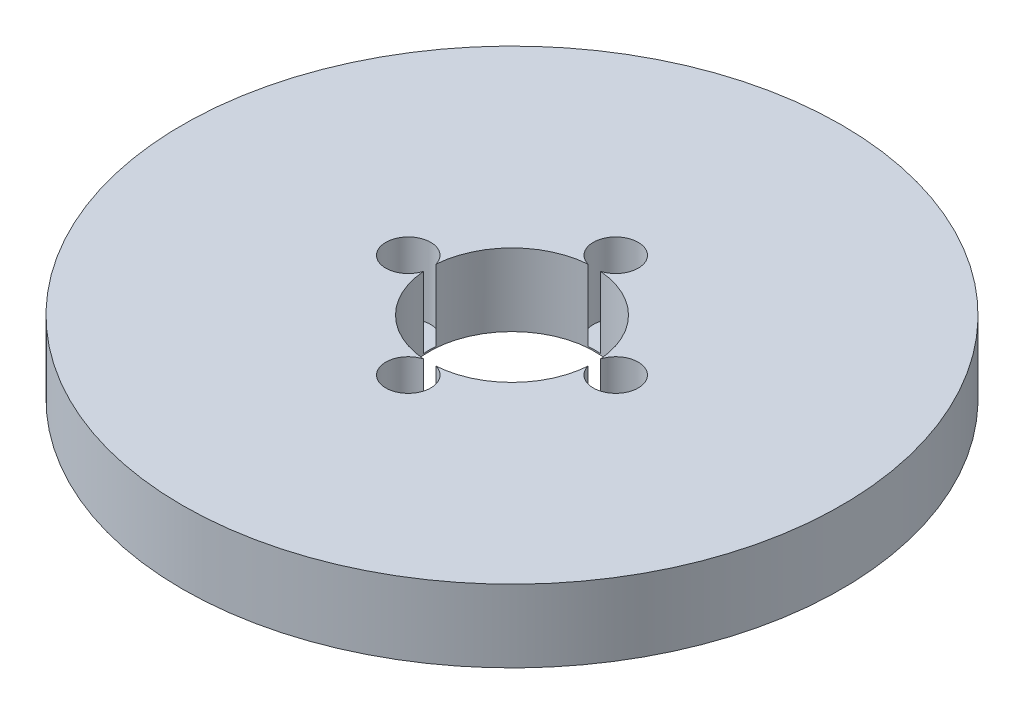
ISO-10303-21;
HEADER;
FILE_DESCRIPTION(('STEP AP214'),'2;1');
FILE_NAME('part.step','',(''),(''),'','','');
FILE_SCHEMA(('AUTOMOTIVE_DESIGN { 1 0 10303 214 1 1 1 1 }'));
ENDSEC;
DATA;
#1=APPLICATION_CONTEXT('core data for automotive mechanical design processes');
#2=APPLICATION_PROTOCOL_DEFINITION('international standard','automotive_design',2000,#1);
#3=PRODUCT_CONTEXT('',#1,'mechanical');
#4=PRODUCT('Part','Part','',(#3));
#5=PRODUCT_RELATED_PRODUCT_CATEGORY('part','',(#4));
#6=PRODUCT_DEFINITION_FORMATION('','',#4);
#7=PRODUCT_DEFINITION_CONTEXT('part definition',#1,'design');
#8=PRODUCT_DEFINITION('design','',#6,#7);
#9=PRODUCT_DEFINITION_SHAPE('','',#8);
#10=(LENGTH_UNIT() NAMED_UNIT(*) SI_UNIT(.MILLI.,.METRE.));
#11=(NAMED_UNIT(*) PLANE_ANGLE_UNIT() SI_UNIT($,.RADIAN.));
#12=(NAMED_UNIT(*) SI_UNIT($,.STERADIAN.) SOLID_ANGLE_UNIT());
#13=UNCERTAINTY_MEASURE_WITH_UNIT(LENGTH_MEASURE(1.E-05),#10,'distance_accuracy_value','');
#14=(GEOMETRIC_REPRESENTATION_CONTEXT(3) GLOBAL_UNCERTAINTY_ASSIGNED_CONTEXT((#13)) GLOBAL_UNIT_ASSIGNED_CONTEXT((#10,
#11,#12)) REPRESENTATION_CONTEXT('',''));
#15=CARTESIAN_POINT('',(0.,0.,0.));
#16=DIRECTION('',(0.,0.,1.));
#17=DIRECTION('',(1.,0.,0.));
#18=AXIS2_PLACEMENT_3D('',#15,#16,#17);
#19=CARTESIAN_POINT('',(0.,11.,0.));
#20=DIRECTION('',(0.,-1.,0.));
#21=DIRECTION('',(0.,0.,-1.));
#22=AXIS2_PLACEMENT_3D('',#19,#20,#21);
#23=CYLINDRICAL_SURFACE('',#22,50.);
#24=CARTESIAN_POINT('',(0.,11.,0.));
#25=DIRECTION('',(0.,1.,0.));
#26=DIRECTION('',(0.,0.,1.));
#27=AXIS2_PLACEMENT_3D('',#24,#25,#26);
#28=CIRCLE('',#27,50.);
#29=CARTESIAN_POINT('',(0.,11.,50.));
#30=VERTEX_POINT('',#29);
#31=EDGE_CURVE('E145',#30,#30,#28,.T.);
#32=ORIENTED_EDGE('',*,*,#31,.F.);
#33=EDGE_LOOP('',(#32));
#34=FACE_BOUND('',#33,.T.);
#35=CARTESIAN_POINT('',(0.,0.,0.));
#36=DIRECTION('',(0.,1.,0.));
#37=DIRECTION('',(0.,0.,1.));
#38=AXIS2_PLACEMENT_3D('',#35,#36,#37);
#39=CIRCLE('',#38,50.);
#40=CARTESIAN_POINT('',(0.,0.,50.));
#41=VERTEX_POINT('',#40);
#42=EDGE_CURVE('E143',#41,#41,#39,.T.);
#43=ORIENTED_EDGE('',*,*,#42,.T.);
#44=EDGE_LOOP('',(#43));
#45=FACE_BOUND('',#44,.T.);
#46=ADVANCED_FACE('F39',(#34,#45),#23,.T.);
#47=CARTESIAN_POINT('',(0.,11.,0.));
#48=DIRECTION('',(0.,1.,0.));
#49=DIRECTION('',(0.,0.,1.));
#50=AXIS2_PLACEMENT_3D('',#47,#48,#49);
#51=PLANE('',#50);
#52=CARTESIAN_POINT('',(0.,11.,15.7398733575074));
#53=DIRECTION('',(0.,1.,0.));
#54=DIRECTION('',(1.,0.,0.));
#55=AXIS2_PLACEMENT_3D('',#52,#53,#54);
#56=CIRCLE('',#55,3.40899028966621);
#57=CARTESIAN_POINT('',(-0.944302572630774,11.,12.464280671235));
#58=VERTEX_POINT('',#57);
#59=CARTESIAN_POINT('',(0.944302572630861,11.,12.464280671235));
#60=VERTEX_POINT('',#59);
#61=EDGE_CURVE('E152',#58,#60,#56,.T.);
#62=ORIENTED_EDGE('',*,*,#61,.F.);
#63=CARTESIAN_POINT('',(0.,11.,0.));
#64=DIRECTION('',(0.,1.,0.));
#65=DIRECTION('',(0.,0.,1.));
#66=AXIS2_PLACEMENT_3D('',#63,#64,#65);
#67=CIRCLE('',#66,12.5);
#68=CARTESIAN_POINT('',(-12.464280671235,11.,0.944302572630818));
#69=VERTEX_POINT('',#68);
#70=EDGE_CURVE('E133',#69,#58,#67,.T.);
#71=ORIENTED_EDGE('',*,*,#70,.F.);
#72=CARTESIAN_POINT('',(-15.7398733575074,11.,0.));
#73=DIRECTION('',(0.,1.,0.));
#74=DIRECTION('',(0.,0.,1.));
#75=AXIS2_PLACEMENT_3D('',#72,#73,#74);
#76=CIRCLE('',#75,3.40899028966621);
#77=CARTESIAN_POINT('',(-12.464280671235,11.,-0.944302572630818));
#78=VERTEX_POINT('',#77);
#79=EDGE_CURVE('E128',#78,#69,#76,.T.);
#80=ORIENTED_EDGE('',*,*,#79,.F.);
#81=CARTESIAN_POINT('',(-0.944302572630948,11.,-12.464280671235));
#82=VERTEX_POINT('',#81);
#83=EDGE_CURVE('E121',#82,#78,#67,.T.);
#84=ORIENTED_EDGE('',*,*,#83,.F.);
#85=CARTESIAN_POINT('',(-1.64866422310474E-13,11.,-15.7398733575074));
#86=DIRECTION('',(0.,1.,0.));
#87=DIRECTION('',(-1.,0.,0.));
#88=AXIS2_PLACEMENT_3D('',#85,#86,#87);
#89=CIRCLE('',#88,3.40899028966621);
#90=CARTESIAN_POINT('',(0.944302572630687,11.,-12.464280671235));
#91=VERTEX_POINT('',#90);
#92=EDGE_CURVE('E105',#91,#82,#89,.T.);
#93=ORIENTED_EDGE('',*,*,#92,.F.);
#94=CARTESIAN_POINT('',(12.464280671235,11.,-0.944302572630818));
#95=VERTEX_POINT('',#94);
#96=EDGE_CURVE('E131',#95,#91,#67,.T.);
#97=ORIENTED_EDGE('',*,*,#96,.F.);
#98=CARTESIAN_POINT('',(15.7398733575074,11.,0.));
#99=DIRECTION('',(0.,1.,0.));
#100=DIRECTION('',(0.,0.,-1.));
#101=AXIS2_PLACEMENT_3D('',#98,#99,#100);
#102=CIRCLE('',#101,3.40899028966621);
#103=CARTESIAN_POINT('',(12.464280671235,11.,0.944302572630818));
#104=VERTEX_POINT('',#103);
#105=EDGE_CURVE('E154',#104,#95,#102,.T.);
#106=ORIENTED_EDGE('',*,*,#105,.F.);
#107=EDGE_CURVE('E134',#60,#104,#67,.T.);
#108=ORIENTED_EDGE('',*,*,#107,.F.);
#109=EDGE_LOOP('',(#62,#71,#80,#84,#93,#97,#106,#108));
#110=FACE_BOUND('',#109,.T.);
#111=ORIENTED_EDGE('',*,*,#31,.T.);
#112=EDGE_LOOP('',(#111));
#113=FACE_BOUND('',#112,.T.);
#114=ADVANCED_FACE('F130',(#110,#113),#51,.T.);
#115=CARTESIAN_POINT('',(0.,0.,0.));
#116=DIRECTION('',(0.,1.,0.));
#117=DIRECTION('',(0.,0.,1.));
#118=AXIS2_PLACEMENT_3D('',#115,#116,#117);
#119=PLANE('',#118);
#120=CARTESIAN_POINT('',(0.,0.,0.));
#121=DIRECTION('',(0.,1.,0.));
#122=DIRECTION('',(0.,0.,1.));
#123=AXIS2_PLACEMENT_3D('',#120,#121,#122);
#124=CIRCLE('',#123,12.5);
#125=CARTESIAN_POINT('',(0.,0.,12.5));
#126=VERTEX_POINT('',#125);
#127=EDGE_CURVE('E135',#126,#126,#124,.T.);
#128=ORIENTED_EDGE('',*,*,#127,.T.);
#129=EDGE_LOOP('',(#128));
#130=FACE_BOUND('',#129,.T.);
#131=ORIENTED_EDGE('',*,*,#42,.F.);
#132=EDGE_LOOP('',(#131));
#133=FACE_BOUND('',#132,.T.);
#134=ADVANCED_FACE('F195',(#130,#133),#119,.F.);
#135=CARTESIAN_POINT('',(0.,11.,0.));
#136=DIRECTION('',(0.,-1.,0.));
#137=DIRECTION('',(0.,0.,-1.));
#138=AXIS2_PLACEMENT_3D('',#135,#136,#137);
#139=CYLINDRICAL_SURFACE('',#138,12.5);
#140=DIRECTION('',(0.,1.,0.));
#141=VECTOR('',#140,1.);
#142=CARTESIAN_POINT('',(-0.944302572630786,5.59821491136933,12.464280671235));
#143=LINE('',#142,#141);
#144=CARTESIAN_POINT('',(-0.944302572630774,0.196429822738669,12.464280671235));
#145=VERTEX_POINT('',#144);
#146=EDGE_CURVE('E11',#145,#58,#143,.T.);
#147=ORIENTED_EDGE('',*,*,#146,.F.);
#148=CARTESIAN_POINT('',(0.,0.196429822738669,0.));
#149=DIRECTION('',(0.,1.,0.));
#150=DIRECTION('',(0.,0.,1.));
#151=AXIS2_PLACEMENT_3D('',#148,#149,#150);
#152=CIRCLE('',#151,12.5);
#153=CARTESIAN_POINT('',(0.944302572630861,0.196429822738669,12.464280671235));
#154=VERTEX_POINT('',#153);
#155=EDGE_CURVE('E169',#145,#154,#152,.T.);
#156=ORIENTED_EDGE('',*,*,#155,.T.);
#157=DIRECTION('',(0.,1.,0.));
#158=VECTOR('',#157,1.);
#159=CARTESIAN_POINT('',(0.944302572630874,5.59821491136933,12.464280671235));
#160=LINE('',#159,#158);
#161=EDGE_CURVE('E46',#60,#154,#160,.F.);
#162=ORIENTED_EDGE('',*,*,#161,.F.);
#163=ORIENTED_EDGE('',*,*,#107,.T.);
#164=DIRECTION('',(0.,1.,0.));
#165=VECTOR('',#164,1.);
#166=CARTESIAN_POINT('',(12.464280671235,5.59821491136933,0.944302572630831));
#167=LINE('',#166,#165);
#168=CARTESIAN_POINT('',(12.464280671235,0.196429822738669,0.944302572630818));
#169=VERTEX_POINT('',#168);
#170=EDGE_CURVE('E151',#169,#104,#167,.T.);
#171=ORIENTED_EDGE('',*,*,#170,.F.);
#172=CARTESIAN_POINT('',(0.,0.196429822738669,0.));
#173=DIRECTION('',(0.,1.,0.));
#174=DIRECTION('',(0.,0.,1.));
#175=AXIS2_PLACEMENT_3D('',#172,#173,#174);
#176=CIRCLE('',#175,12.5);
#177=CARTESIAN_POINT('',(12.464280671235,0.196429822738669,-0.944302572630818));
#178=VERTEX_POINT('',#177);
#179=EDGE_CURVE('E173',#169,#178,#176,.T.);
#180=ORIENTED_EDGE('',*,*,#179,.T.);
#181=DIRECTION('',(0.,1.,0.));
#182=VECTOR('',#181,1.);
#183=CARTESIAN_POINT('',(12.464280671235,5.59821491136933,-0.944302572630831));
#184=LINE('',#183,#182);
#185=EDGE_CURVE('E168',#95,#178,#184,.F.);
#186=ORIENTED_EDGE('',*,*,#185,.F.);
#187=ORIENTED_EDGE('',*,*,#96,.T.);
#188=DIRECTION('',(0.,1.,0.));
#189=VECTOR('',#188,1.);
#190=CARTESIAN_POINT('',(0.944302572630699,5.59821491136933,-12.464280671235));
#191=LINE('',#190,#189);
#192=CARTESIAN_POINT('',(0.944302572630687,0.196429822738669,-12.464280671235));
#193=VERTEX_POINT('',#192);
#194=EDGE_CURVE('E108',#193,#91,#191,.T.);
#195=ORIENTED_EDGE('',*,*,#194,.F.);
#196=CARTESIAN_POINT('',(0.,0.196429822738669,0.));
#197=DIRECTION('',(0.,1.,0.));
#198=DIRECTION('',(0.,0.,1.));
#199=AXIS2_PLACEMENT_3D('',#196,#197,#198);
#200=CIRCLE('',#199,12.5);
#201=CARTESIAN_POINT('',(-0.944302572630948,0.196429822738669,-12.464280671235));
#202=VERTEX_POINT('',#201);
#203=EDGE_CURVE('E122',#193,#202,#200,.T.);
#204=ORIENTED_EDGE('',*,*,#203,.T.);
#205=DIRECTION('',(0.,1.,0.));
#206=VECTOR('',#205,1.);
#207=CARTESIAN_POINT('',(-0.944302572630961,5.59821491136933,-12.464280671235));
#208=LINE('',#207,#206);
#209=EDGE_CURVE('E106',#82,#202,#208,.F.);
#210=ORIENTED_EDGE('',*,*,#209,.F.);
#211=ORIENTED_EDGE('',*,*,#83,.T.);
#212=DIRECTION('',(0.,1.,0.));
#213=VECTOR('',#212,1.);
#214=CARTESIAN_POINT('',(-12.464280671235,5.59821491136933,-0.944302572630831));
#215=LINE('',#214,#213);
#216=CARTESIAN_POINT('',(-12.464280671235,0.196429822738669,-0.944302572630818));
#217=VERTEX_POINT('',#216);
#218=EDGE_CURVE('E177',#217,#78,#215,.T.);
#219=ORIENTED_EDGE('',*,*,#218,.F.);
#220=CARTESIAN_POINT('',(0.,0.196429822738669,0.));
#221=DIRECTION('',(0.,1.,0.));
#222=DIRECTION('',(0.,0.,1.));
#223=AXIS2_PLACEMENT_3D('',#220,#221,#222);
#224=CIRCLE('',#223,12.5);
#225=CARTESIAN_POINT('',(-12.464280671235,0.196429822738669,0.944302572630818));
#226=VERTEX_POINT('',#225);
#227=EDGE_CURVE('E185',#217,#226,#224,.T.);
#228=ORIENTED_EDGE('',*,*,#227,.T.);
#229=DIRECTION('',(0.,1.,0.));
#230=VECTOR('',#229,1.);
#231=CARTESIAN_POINT('',(-12.464280671235,5.59821491136933,0.944302572630831));
#232=LINE('',#231,#230);
#233=EDGE_CURVE('E179',#69,#226,#232,.F.);
#234=ORIENTED_EDGE('',*,*,#233,.F.);
#235=ORIENTED_EDGE('',*,*,#70,.T.);
#236=EDGE_LOOP('',(#147,#156,#162,#163,#171,#180,#186,#187,#195,#204,#210,#211,#219,#228,#234,#235));
#237=FACE_BOUND('',#236,.T.);
#238=ORIENTED_EDGE('',*,*,#127,.F.);
#239=EDGE_LOOP('',(#238));
#240=FACE_BOUND('',#239,.T.);
#241=ADVANCED_FACE('F117',(#237,#240),#139,.F.);
#242=CARTESIAN_POINT('',(-15.7398733575074,0.196429822738669,0.));
#243=DIRECTION('',(0.,1.,0.));
#244=DIRECTION('',(0.,0.,1.));
#245=AXIS2_PLACEMENT_3D('',#242,#243,#244);
#246=CYLINDRICAL_SURFACE('',#245,3.40899028966621);
#247=ORIENTED_EDGE('',*,*,#218,.T.);
#248=ORIENTED_EDGE('',*,*,#79,.T.);
#249=ORIENTED_EDGE('',*,*,#233,.T.);
#250=CARTESIAN_POINT('',(-15.7398733575074,0.196429822738669,0.));
#251=DIRECTION('',(0.,1.,0.));
#252=DIRECTION('',(0.,0.,1.));
#253=AXIS2_PLACEMENT_3D('',#250,#251,#252);
#254=CIRCLE('',#253,3.40899028966621);
#255=EDGE_CURVE('E140',#217,#226,#254,.T.);
#256=ORIENTED_EDGE('',*,*,#255,.F.);
#257=EDGE_LOOP('',(#247,#248,#249,#256));
#258=FACE_BOUND('',#257,.T.);
#259=ADVANCED_FACE('F200',(#258),#246,.F.);
#260=CARTESIAN_POINT('',(-15.7398733575074,0.196429822738669,0.));
#261=DIRECTION('',(0.,1.,0.));
#262=DIRECTION('',(0.,0.,1.));
#263=AXIS2_PLACEMENT_3D('',#260,#261,#262);
#264=PLANE('',#263);
#265=ORIENTED_EDGE('',*,*,#255,.T.);
#266=ORIENTED_EDGE('',*,*,#227,.F.);
#267=EDGE_LOOP('',(#265,#266));
#268=FACE_BOUND('',#267,.T.);
#269=ADVANCED_FACE('F202',(#268),#264,.T.);
#270=CARTESIAN_POINT('',(-1.64866422310474E-13,0.196429822738669,-15.7398733575074));
#271=DIRECTION('',(0.,1.,0.));
#272=DIRECTION('',(0.,0.,1.));
#273=AXIS2_PLACEMENT_3D('',#270,#271,#272);
#274=CYLINDRICAL_SURFACE('',#273,3.40899028966621);
#275=ORIENTED_EDGE('',*,*,#194,.T.);
#276=ORIENTED_EDGE('',*,*,#92,.T.);
#277=ORIENTED_EDGE('',*,*,#209,.T.);
#278=CARTESIAN_POINT('',(-1.64866422310474E-13,0.196429822738669,-15.7398733575074));
#279=DIRECTION('',(0.,1.,0.));
#280=DIRECTION('',(-1.,0.,0.));
#281=AXIS2_PLACEMENT_3D('',#278,#279,#280);
#282=CIRCLE('',#281,3.40899028966621);
#283=EDGE_CURVE('E111',#193,#202,#282,.T.);
#284=ORIENTED_EDGE('',*,*,#283,.F.);
#285=EDGE_LOOP('',(#275,#276,#277,#284));
#286=FACE_BOUND('',#285,.T.);
#287=ADVANCED_FACE('F102',(#286),#274,.F.);
#288=CARTESIAN_POINT('',(-1.64866422310474E-13,0.196429822738669,-15.7398733575074));
#289=DIRECTION('',(0.,1.,0.));
#290=DIRECTION('',(-1.,0.,0.));
#291=AXIS2_PLACEMENT_3D('',#288,#289,#290);
#292=PLANE('',#291);
#293=ORIENTED_EDGE('',*,*,#283,.T.);
#294=ORIENTED_EDGE('',*,*,#203,.F.);
#295=EDGE_LOOP('',(#293,#294));
#296=FACE_BOUND('',#295,.T.);
#297=ADVANCED_FACE('F211',(#296),#292,.T.);
#298=CARTESIAN_POINT('',(15.7398733575074,0.196429822738669,0.));
#299=DIRECTION('',(0.,1.,0.));
#300=DIRECTION('',(0.,0.,1.));
#301=AXIS2_PLACEMENT_3D('',#298,#299,#300);
#302=CYLINDRICAL_SURFACE('',#301,3.40899028966621);
#303=ORIENTED_EDGE('',*,*,#170,.T.);
#304=ORIENTED_EDGE('',*,*,#105,.T.);
#305=ORIENTED_EDGE('',*,*,#185,.T.);
#306=CARTESIAN_POINT('',(15.7398733575074,0.196429822738669,0.));
#307=DIRECTION('',(0.,1.,0.));
#308=DIRECTION('',(0.,0.,-1.));
#309=AXIS2_PLACEMENT_3D('',#306,#307,#308);
#310=CIRCLE('',#309,3.40899028966621);
#311=EDGE_CURVE('E56',#169,#178,#310,.T.);
#312=ORIENTED_EDGE('',*,*,#311,.F.);
#313=EDGE_LOOP('',(#303,#304,#305,#312));
#314=FACE_BOUND('',#313,.T.);
#315=ADVANCED_FACE('F212',(#314),#302,.F.);
#316=CARTESIAN_POINT('',(15.7398733575074,0.196429822738669,0.));
#317=DIRECTION('',(0.,1.,0.));
#318=DIRECTION('',(0.,0.,-1.));
#319=AXIS2_PLACEMENT_3D('',#316,#317,#318);
#320=PLANE('',#319);
#321=ORIENTED_EDGE('',*,*,#311,.T.);
#322=ORIENTED_EDGE('',*,*,#179,.F.);
#323=EDGE_LOOP('',(#321,#322));
#324=FACE_BOUND('',#323,.T.);
#325=ADVANCED_FACE('F217',(#324),#320,.T.);
#326=CARTESIAN_POINT('',(0.,0.196429822738669,15.7398733575074));
#327=DIRECTION('',(0.,1.,0.));
#328=DIRECTION('',(0.,0.,1.));
#329=AXIS2_PLACEMENT_3D('',#326,#327,#328);
#330=CYLINDRICAL_SURFACE('',#329,3.40899028966621);
#331=ORIENTED_EDGE('',*,*,#146,.T.);
#332=ORIENTED_EDGE('',*,*,#61,.T.);
#333=ORIENTED_EDGE('',*,*,#161,.T.);
#334=CARTESIAN_POINT('',(0.,0.196429822738669,15.7398733575074));
#335=DIRECTION('',(0.,1.,0.));
#336=DIRECTION('',(1.,0.,0.));
#337=AXIS2_PLACEMENT_3D('',#334,#335,#336);
#338=CIRCLE('',#337,3.40899028966621);
#339=EDGE_CURVE('E55',#145,#154,#338,.T.);
#340=ORIENTED_EDGE('',*,*,#339,.F.);
#341=EDGE_LOOP('',(#331,#332,#333,#340));
#342=FACE_BOUND('',#341,.T.);
#343=ADVANCED_FACE('F170',(#342),#330,.F.);
#344=CARTESIAN_POINT('',(0.,0.196429822738669,15.7398733575074));
#345=DIRECTION('',(0.,1.,0.));
#346=DIRECTION('',(1.,0.,0.));
#347=AXIS2_PLACEMENT_3D('',#344,#345,#346);
#348=PLANE('',#347);
#349=ORIENTED_EDGE('',*,*,#339,.T.);
#350=ORIENTED_EDGE('',*,*,#155,.F.);
#351=EDGE_LOOP('',(#349,#350));
#352=FACE_BOUND('',#351,.T.);
#353=ADVANCED_FACE('F224',(#352),#348,.T.);
#354=CLOSED_SHELL('',(#46,#114,#134,#241,#259,#269,#287,#297,#315,#325,#343,#353));
#355=MANIFOLD_SOLID_BREP('B2',#354);
#356=ADVANCED_BREP_SHAPE_REPRESENTATION('',(#18,#355),#14);
#357=SHAPE_DEFINITION_REPRESENTATION(#9,#356);
ENDSEC;
END-ISO-10303-21;
